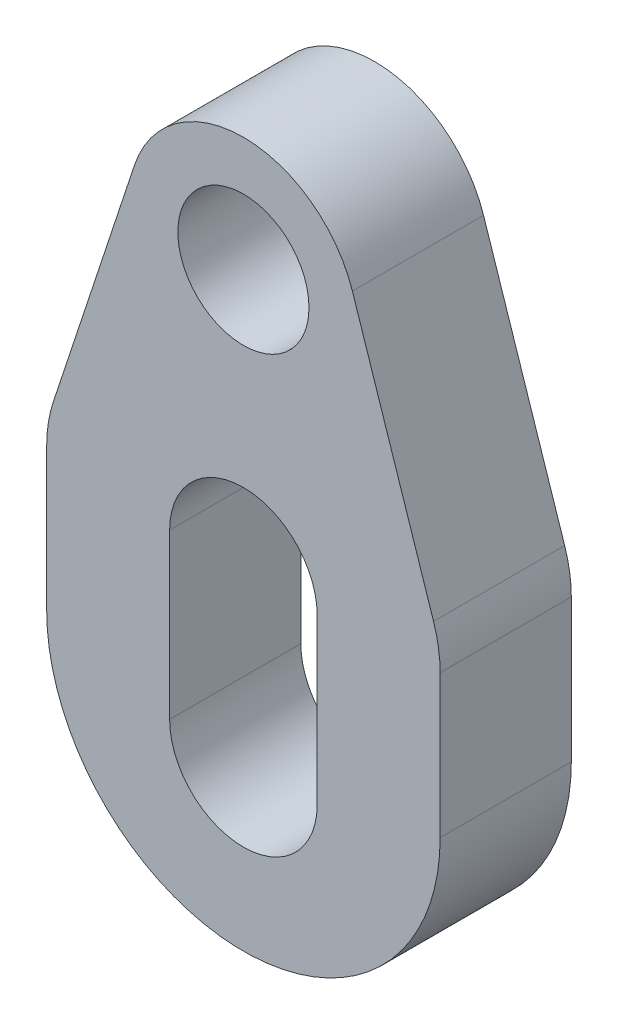
ISO-10303-21;
HEADER;
FILE_DESCRIPTION(('STEP AP214'),'2;1');
FILE_NAME('part.step','',(''),(''),'','','');
FILE_SCHEMA(('AUTOMOTIVE_DESIGN { 1 0 10303 214 1 1 1 1 }'));
ENDSEC;
DATA;
#1=APPLICATION_CONTEXT('core data for automotive mechanical design processes');
#2=APPLICATION_PROTOCOL_DEFINITION('international standard','automotive_design',2000,#1);
#3=PRODUCT_CONTEXT('',#1,'mechanical');
#4=PRODUCT('Part','Part','',(#3));
#5=PRODUCT_RELATED_PRODUCT_CATEGORY('part','',(#4));
#6=PRODUCT_DEFINITION_FORMATION('','',#4);
#7=PRODUCT_DEFINITION_CONTEXT('part definition',#1,'design');
#8=PRODUCT_DEFINITION('design','',#6,#7);
#9=PRODUCT_DEFINITION_SHAPE('','',#8);
#10=(LENGTH_UNIT() NAMED_UNIT(*) SI_UNIT(.MILLI.,.METRE.));
#11=(NAMED_UNIT(*) PLANE_ANGLE_UNIT() SI_UNIT($,.RADIAN.));
#12=(NAMED_UNIT(*) SI_UNIT($,.STERADIAN.) SOLID_ANGLE_UNIT());
#13=UNCERTAINTY_MEASURE_WITH_UNIT(LENGTH_MEASURE(1.E-05),#10,'distance_accuracy_value','');
#14=(GEOMETRIC_REPRESENTATION_CONTEXT(3) GLOBAL_UNCERTAINTY_ASSIGNED_CONTEXT((#13)) GLOBAL_UNIT_ASSIGNED_CONTEXT((#10,
#11,#12)) REPRESENTATION_CONTEXT('',''));
#15=CARTESIAN_POINT('',(0.,0.,0.));
#16=DIRECTION('',(0.,0.,1.));
#17=DIRECTION('',(1.,0.,0.));
#18=AXIS2_PLACEMENT_3D('',#15,#16,#17);
#19=CARTESIAN_POINT('',(-9.525,7.93749999999999,6.35));
#20=DIRECTION('',(1.,0.,0.));
#21=DIRECTION('',(0.,1.,0.));
#22=AXIS2_PLACEMENT_3D('',#19,#20,#21);
#23=PLANE('',#22);
#24=DIRECTION('',(0.,-1.,0.));
#25=VECTOR('',#24,1.);
#26=CARTESIAN_POINT('',(-9.525,7.93749999999999,6.35));
#27=LINE('',#26,#25);
#28=CARTESIAN_POINT('',(-9.525,-1.02225712598016,6.35));
#29=VERTEX_POINT('',#28);
#30=CARTESIAN_POINT('',(-9.525,-7.9375,6.35));
#31=VERTEX_POINT('',#30);
#32=EDGE_CURVE('E201',#29,#31,#27,.T.);
#33=ORIENTED_EDGE('',*,*,#32,.F.);
#34=DIRECTION('',(0.,0.,1.));
#35=VECTOR('',#34,1.);
#36=CARTESIAN_POINT('',(-9.525,-1.02225712598016,0.));
#37=LINE('',#36,#35);
#38=CARTESIAN_POINT('',(-9.525,-1.02225712598016,0.));
#39=VERTEX_POINT('',#38);
#40=EDGE_CURVE('E50',#29,#39,#37,.F.);
#41=ORIENTED_EDGE('',*,*,#40,.T.);
#42=DIRECTION('',(0.,-1.,0.));
#43=VECTOR('',#42,1.);
#44=CARTESIAN_POINT('',(-9.525,7.93749999999999,0.));
#45=LINE('',#44,#43);
#46=CARTESIAN_POINT('',(-9.525,-7.9375,0.));
#47=VERTEX_POINT('',#46);
#48=EDGE_CURVE('E200',#39,#47,#45,.T.);
#49=ORIENTED_EDGE('',*,*,#48,.T.);
#50=DIRECTION('',(0.,0.,-1.));
#51=VECTOR('',#50,1.);
#52=CARTESIAN_POINT('',(-9.525,-7.9375,6.35));
#53=LINE('',#52,#51);
#54=EDGE_CURVE('E217',#31,#47,#53,.T.);
#55=ORIENTED_EDGE('',*,*,#54,.F.);
#56=EDGE_LOOP('',(#33,#41,#49,#55));
#57=FACE_BOUND('',#56,.T.);
#58=ADVANCED_FACE('F42',(#57),#23,.F.);
#59=CARTESIAN_POINT('',(9.52499999999999,7.93750000000001,6.35));
#60=DIRECTION('',(-1.,0.,0.));
#61=DIRECTION('',(0.,-1.,0.));
#62=AXIS2_PLACEMENT_3D('',#59,#60,#61);
#63=PLANE('',#62);
#64=DIRECTION('',(0.,1.,0.));
#65=VECTOR('',#64,1.);
#66=CARTESIAN_POINT('',(9.52499999999999,7.93750000000001,0.));
#67=LINE('',#66,#65);
#68=CARTESIAN_POINT('',(9.525,-7.9375,0.));
#69=VERTEX_POINT('',#68);
#70=CARTESIAN_POINT('',(9.525,-1.02225712598016,0.));
#71=VERTEX_POINT('',#70);
#72=EDGE_CURVE('E204',#69,#71,#67,.T.);
#73=ORIENTED_EDGE('',*,*,#72,.T.);
#74=DIRECTION('',(0.,0.,1.));
#75=VECTOR('',#74,1.);
#76=CARTESIAN_POINT('',(9.525,-1.02225712598016,6.35));
#77=LINE('',#76,#75);
#78=CARTESIAN_POINT('',(9.525,-1.02225712598016,6.35));
#79=VERTEX_POINT('',#78);
#80=EDGE_CURVE('E225',#71,#79,#77,.T.);
#81=ORIENTED_EDGE('',*,*,#80,.T.);
#82=DIRECTION('',(0.,1.,0.));
#83=VECTOR('',#82,1.);
#84=CARTESIAN_POINT('',(9.52499999999999,7.93750000000001,6.35));
#85=LINE('',#84,#83);
#86=CARTESIAN_POINT('',(9.525,-7.9375,6.35));
#87=VERTEX_POINT('',#86);
#88=EDGE_CURVE('E206',#87,#79,#85,.T.);
#89=ORIENTED_EDGE('',*,*,#88,.F.);
#90=DIRECTION('',(0.,0.,-1.));
#91=VECTOR('',#90,1.);
#92=CARTESIAN_POINT('',(9.525,-7.9375,6.35));
#93=LINE('',#92,#91);
#94=EDGE_CURVE('E209',#87,#69,#93,.T.);
#95=ORIENTED_EDGE('',*,*,#94,.T.);
#96=EDGE_LOOP('',(#73,#81,#89,#95));
#97=FACE_BOUND('',#96,.T.);
#98=ADVANCED_FACE('F243',(#97),#63,.F.);
#99=CARTESIAN_POINT('',(0.,7.9375,6.35));
#100=DIRECTION('',(0.,0.,1.));
#101=DIRECTION('',(1.,0.,0.));
#102=AXIS2_PLACEMENT_3D('',#99,#100,#101);
#103=PLANE('',#102);
#104=DIRECTION('',(0.,-1.,0.));
#105=VECTOR('',#104,1.);
#106=CARTESIAN_POINT('',(-3.571875,-9.525,6.35));
#107=LINE('',#106,#105);
#108=CARTESIAN_POINT('',(-3.571875,-1.5875,6.35));
#109=VERTEX_POINT('',#108);
#110=CARTESIAN_POINT('',(-3.571875,-9.525,6.35));
#111=VERTEX_POINT('',#110);
#112=EDGE_CURVE('E180',#109,#111,#107,.T.);
#113=ORIENTED_EDGE('',*,*,#112,.F.);
#114=CARTESIAN_POINT('',(0.,-1.5875,6.35));
#115=DIRECTION('',(0.,0.,1.));
#116=DIRECTION('',(1.,0.,0.));
#117=AXIS2_PLACEMENT_3D('',#114,#115,#116);
#118=CIRCLE('',#117,3.571875);
#119=CARTESIAN_POINT('',(3.571875,-1.5875,6.35));
#120=VERTEX_POINT('',#119);
#121=EDGE_CURVE('E177',#120,#109,#118,.T.);
#122=ORIENTED_EDGE('',*,*,#121,.F.);
#123=DIRECTION('',(0.,1.,0.));
#124=VECTOR('',#123,1.);
#125=CARTESIAN_POINT('',(3.571875,-9.525,6.35));
#126=LINE('',#125,#124);
#127=CARTESIAN_POINT('',(3.571875,-9.525,6.35));
#128=VERTEX_POINT('',#127);
#129=EDGE_CURVE('E174',#128,#120,#126,.T.);
#130=ORIENTED_EDGE('',*,*,#129,.F.);
#131=CARTESIAN_POINT('',(0.,-9.525,6.35));
#132=DIRECTION('',(0.,0.,1.));
#133=DIRECTION('',(1.,0.,0.));
#134=AXIS2_PLACEMENT_3D('',#131,#132,#133);
#135=CIRCLE('',#134,3.571875);
#136=EDGE_CURVE('E188',#111,#128,#135,.T.);
#137=ORIENTED_EDGE('',*,*,#136,.F.);
#138=EDGE_LOOP('',(#113,#122,#130,#137));
#139=FACE_BOUND('',#138,.T.);
#140=CARTESIAN_POINT('',(0.,11.1125,6.35));
#141=DIRECTION('',(0.,0.,1.));
#142=DIRECTION('',(1.,0.,0.));
#143=AXIS2_PLACEMENT_3D('',#140,#141,#142);
#144=CIRCLE('',#143,3.175);
#145=CARTESIAN_POINT('',(3.175,11.1125,6.35));
#146=VERTEX_POINT('',#145);
#147=EDGE_CURVE('E194',#146,#146,#144,.T.);
#148=ORIENTED_EDGE('',*,*,#147,.F.);
#149=EDGE_LOOP('',(#148));
#150=FACE_BOUND('',#149,.T.);
#151=ORIENTED_EDGE('',*,*,#88,.T.);
#152=CARTESIAN_POINT('',(3.175,-1.02225712598016,6.35));
#153=DIRECTION('',(0.,0.,1.));
#154=DIRECTION('',(1.,0.,0.));
#155=AXIS2_PLACEMENT_3D('',#152,#153,#154);
#156=CIRCLE('',#155,6.35);
#157=CARTESIAN_POINT('',(9.20417763385506,0.970609417324182,6.35));
#158=VERTEX_POINT('',#157);
#159=EDGE_CURVE('E228',#79,#158,#156,.T.);
#160=ORIENTED_EDGE('',*,*,#159,.T.);
#161=DIRECTION('',(0.31383725091407,-0.949476792733082,0.));
#162=VECTOR('',#161,1.);
#163=CARTESIAN_POINT('',(8.58684636391611,2.8382708008225,6.35));
#164=LINE('',#163,#162);
#165=CARTESIAN_POINT('',(5.27553042962318,12.8562582253913,6.35));
#166=VERTEX_POINT('',#165);
#167=EDGE_CURVE('E155',#166,#158,#164,.T.);
#168=ORIENTED_EDGE('',*,*,#167,.F.);
#169=CARTESIAN_POINT('',(0.,11.1125,6.35));
#170=DIRECTION('',(0.,0.,1.));
#171=DIRECTION('',(1.,0.,0.));
#172=AXIS2_PLACEMENT_3D('',#169,#170,#171);
#173=CIRCLE('',#172,5.55625);
#174=CARTESIAN_POINT('',(-5.27553042962318,12.8562582253913,6.35));
#175=VERTEX_POINT('',#174);
#176=EDGE_CURVE('E148',#166,#175,#173,.T.);
#177=ORIENTED_EDGE('',*,*,#176,.T.);
#178=DIRECTION('',(0.31383725091407,0.949476792733082,0.));
#179=VECTOR('',#178,1.);
#180=CARTESIAN_POINT('',(-8.58684636391611,2.83827080082251,6.35));
#181=LINE('',#180,#179);
#182=CARTESIAN_POINT('',(-9.20417763385507,0.970609417324181,6.35));
#183=VERTEX_POINT('',#182);
#184=EDGE_CURVE('E158',#183,#175,#181,.T.);
#185=ORIENTED_EDGE('',*,*,#184,.F.);
#186=CARTESIAN_POINT('',(-3.175,-1.02225712598016,6.35));
#187=DIRECTION('',(0.,0.,1.));
#188=DIRECTION('',(1.,0.,0.));
#189=AXIS2_PLACEMENT_3D('',#186,#187,#188);
#190=CIRCLE('',#189,6.35);
#191=EDGE_CURVE('E57',#183,#29,#190,.T.);
#192=ORIENTED_EDGE('',*,*,#191,.T.);
#193=ORIENTED_EDGE('',*,*,#32,.T.);
#194=CARTESIAN_POINT('',(0.,-7.9375,6.35));
#195=DIRECTION('',(0.,0.,1.));
#196=DIRECTION('',(1.,0.,0.));
#197=AXIS2_PLACEMENT_3D('',#194,#195,#196);
#198=CIRCLE('',#197,9.525);
#199=EDGE_CURVE('E203',#31,#87,#198,.T.);
#200=ORIENTED_EDGE('',*,*,#199,.T.);
#201=EDGE_LOOP('',(#151,#160,#168,#177,#185,#192,#193,#200));
#202=FACE_BOUND('',#201,.T.);
#203=ADVANCED_FACE('F246',(#139,#150,#202),#103,.T.);
#204=CARTESIAN_POINT('',(0.,7.9375,0.));
#205=DIRECTION('',(0.,0.,1.));
#206=DIRECTION('',(1.,0.,0.));
#207=AXIS2_PLACEMENT_3D('',#204,#205,#206);
#208=PLANE('',#207);
#209=CARTESIAN_POINT('',(0.,11.1125,0.));
#210=DIRECTION('',(0.,0.,1.));
#211=DIRECTION('',(1.,0.,0.));
#212=AXIS2_PLACEMENT_3D('',#209,#210,#211);
#213=CIRCLE('',#212,3.175);
#214=CARTESIAN_POINT('',(3.175,11.1125,0.));
#215=VERTEX_POINT('',#214);
#216=EDGE_CURVE('E197',#215,#215,#213,.T.);
#217=ORIENTED_EDGE('',*,*,#216,.T.);
#218=EDGE_LOOP('',(#217));
#219=FACE_BOUND('',#218,.T.);
#220=CARTESIAN_POINT('',(0.,-1.5875,0.));
#221=DIRECTION('',(0.,0.,1.));
#222=DIRECTION('',(1.,0.,0.));
#223=AXIS2_PLACEMENT_3D('',#220,#221,#222);
#224=CIRCLE('',#223,3.571875);
#225=CARTESIAN_POINT('',(-3.571875,-1.5875,0.));
#226=VERTEX_POINT('',#225);
#227=CARTESIAN_POINT('',(3.571875,-1.5875,0.));
#228=VERTEX_POINT('',#227);
#229=EDGE_CURVE('E168',#226,#228,#224,.F.);
#230=ORIENTED_EDGE('',*,*,#229,.F.);
#231=DIRECTION('',(0.,1.,0.));
#232=VECTOR('',#231,1.);
#233=CARTESIAN_POINT('',(-3.571875,-9.525,0.));
#234=LINE('',#233,#232);
#235=CARTESIAN_POINT('',(-3.571875,-9.525,0.));
#236=VERTEX_POINT('',#235);
#237=EDGE_CURVE('E171',#236,#226,#234,.T.);
#238=ORIENTED_EDGE('',*,*,#237,.F.);
#239=CARTESIAN_POINT('',(0.,-9.525,0.));
#240=DIRECTION('',(0.,0.,1.));
#241=DIRECTION('',(1.,0.,0.));
#242=AXIS2_PLACEMENT_3D('',#239,#240,#241);
#243=CIRCLE('',#242,3.571875);
#244=CARTESIAN_POINT('',(3.571875,-9.525,0.));
#245=VERTEX_POINT('',#244);
#246=EDGE_CURVE('E191',#236,#245,#243,.T.);
#247=ORIENTED_EDGE('',*,*,#246,.T.);
#248=DIRECTION('',(0.,-1.,0.));
#249=VECTOR('',#248,1.);
#250=CARTESIAN_POINT('',(3.571875,-9.525,0.));
#251=LINE('',#250,#249);
#252=EDGE_CURVE('E185',#228,#245,#251,.T.);
#253=ORIENTED_EDGE('',*,*,#252,.F.);
#254=EDGE_LOOP('',(#230,#238,#247,#253));
#255=FACE_BOUND('',#254,.T.);
#256=DIRECTION('',(0.31383725091407,-0.949476792733082,0.));
#257=VECTOR('',#256,1.);
#258=CARTESIAN_POINT('',(8.58684636391611,2.8382708008225,0.));
#259=LINE('',#258,#257);
#260=CARTESIAN_POINT('',(5.27553042962318,12.8562582253913,0.));
#261=VERTEX_POINT('',#260);
#262=CARTESIAN_POINT('',(9.20417763385506,0.970609417324182,0.));
#263=VERTEX_POINT('',#262);
#264=EDGE_CURVE('E131',#261,#263,#259,.T.);
#265=ORIENTED_EDGE('',*,*,#264,.T.);
#266=CARTESIAN_POINT('',(3.175,-1.02225712598016,0.));
#267=DIRECTION('',(0.,0.,1.));
#268=DIRECTION('',(1.,0.,0.));
#269=AXIS2_PLACEMENT_3D('',#266,#267,#268);
#270=CIRCLE('',#269,6.35);
#271=EDGE_CURVE('E223',#263,#71,#270,.F.);
#272=ORIENTED_EDGE('',*,*,#271,.T.);
#273=ORIENTED_EDGE('',*,*,#72,.F.);
#274=CARTESIAN_POINT('',(0.,-7.9375,0.));
#275=DIRECTION('',(0.,0.,1.));
#276=DIRECTION('',(1.,0.,0.));
#277=AXIS2_PLACEMENT_3D('',#274,#275,#276);
#278=CIRCLE('',#277,9.525);
#279=EDGE_CURVE('E211',#47,#69,#278,.T.);
#280=ORIENTED_EDGE('',*,*,#279,.F.);
#281=ORIENTED_EDGE('',*,*,#48,.F.);
#282=CARTESIAN_POINT('',(-3.175,-1.02225712598016,0.));
#283=DIRECTION('',(0.,0.,1.));
#284=DIRECTION('',(1.,0.,0.));
#285=AXIS2_PLACEMENT_3D('',#282,#283,#284);
#286=CIRCLE('',#285,6.35);
#287=CARTESIAN_POINT('',(-9.20417763385507,0.970609417324181,0.));
#288=VERTEX_POINT('',#287);
#289=EDGE_CURVE('E221',#39,#288,#286,.F.);
#290=ORIENTED_EDGE('',*,*,#289,.T.);
#291=DIRECTION('',(0.31383725091407,0.949476792733082,0.));
#292=VECTOR('',#291,1.);
#293=CARTESIAN_POINT('',(-8.58684636391611,2.83827080082251,0.));
#294=LINE('',#293,#292);
#295=CARTESIAN_POINT('',(-5.27553042962318,12.8562582253913,0.));
#296=VERTEX_POINT('',#295);
#297=EDGE_CURVE('E152',#288,#296,#294,.T.);
#298=ORIENTED_EDGE('',*,*,#297,.T.);
#299=CARTESIAN_POINT('',(0.,11.1125,0.));
#300=DIRECTION('',(0.,0.,1.));
#301=DIRECTION('',(1.,0.,0.));
#302=AXIS2_PLACEMENT_3D('',#299,#300,#301);
#303=CIRCLE('',#302,5.55625);
#304=EDGE_CURVE('E141',#261,#296,#303,.T.);
#305=ORIENTED_EDGE('',*,*,#304,.F.);
#306=EDGE_LOOP('',(#265,#272,#273,#280,#281,#290,#298,#305));
#307=FACE_BOUND('',#306,.T.);
#308=ADVANCED_FACE('F151',(#219,#255,#307),#208,.F.);
#309=CARTESIAN_POINT('',(0.,-9.525,6.35));
#310=DIRECTION('',(0.,0.,1.));
#311=DIRECTION('',(1.,0.,0.));
#312=AXIS2_PLACEMENT_3D('',#309,#310,#311);
#313=CYLINDRICAL_SURFACE('',#312,3.571875);
#314=DIRECTION('',(0.,0.,1.));
#315=VECTOR('',#314,1.);
#316=CARTESIAN_POINT('',(-3.571875,-9.525,6.35));
#317=LINE('',#316,#315);
#318=EDGE_CURVE('E165',#236,#111,#317,.T.);
#319=ORIENTED_EDGE('',*,*,#318,.T.);
#320=ORIENTED_EDGE('',*,*,#136,.T.);
#321=DIRECTION('',(0.,0.,1.));
#322=VECTOR('',#321,1.);
#323=CARTESIAN_POINT('',(3.571875,-9.525,6.35));
#324=LINE('',#323,#322);
#325=EDGE_CURVE('E163',#245,#128,#324,.T.);
#326=ORIENTED_EDGE('',*,*,#325,.F.);
#327=ORIENTED_EDGE('',*,*,#246,.F.);
#328=EDGE_LOOP('',(#319,#320,#326,#327));
#329=FACE_BOUND('',#328,.T.);
#330=ADVANCED_FACE('F265',(#329),#313,.F.);
#331=CARTESIAN_POINT('',(0.,-7.9375,6.35));
#332=DIRECTION('',(0.,0.,-1.));
#333=DIRECTION('',(-1.,0.,0.));
#334=AXIS2_PLACEMENT_3D('',#331,#332,#333);
#335=CYLINDRICAL_SURFACE('',#334,9.525);
#336=ORIENTED_EDGE('',*,*,#279,.T.);
#337=ORIENTED_EDGE('',*,*,#94,.F.);
#338=ORIENTED_EDGE('',*,*,#199,.F.);
#339=ORIENTED_EDGE('',*,*,#54,.T.);
#340=EDGE_LOOP('',(#336,#337,#338,#339));
#341=FACE_BOUND('',#340,.T.);
#342=ADVANCED_FACE('F239',(#341),#335,.T.);
#343=CARTESIAN_POINT('',(0.,11.1125,6.35));
#344=DIRECTION('',(0.,0.,1.));
#345=DIRECTION('',(1.,0.,0.));
#346=AXIS2_PLACEMENT_3D('',#343,#344,#345);
#347=CYLINDRICAL_SURFACE('',#346,3.175);
#348=ORIENTED_EDGE('',*,*,#216,.F.);
#349=EDGE_LOOP('',(#348));
#350=FACE_BOUND('',#349,.T.);
#351=ORIENTED_EDGE('',*,*,#147,.T.);
#352=EDGE_LOOP('',(#351));
#353=FACE_BOUND('',#352,.T.);
#354=ADVANCED_FACE('F264',(#350,#353),#347,.F.);
#355=CARTESIAN_POINT('',(-3.571875,-9.525,-0.00100000000000013));
#356=DIRECTION('',(-1.,0.,0.));
#357=DIRECTION('',(0.,0.,1.));
#358=AXIS2_PLACEMENT_3D('',#355,#356,#357);
#359=PLANE('',#358);
#360=ORIENTED_EDGE('',*,*,#237,.T.);
#361=DIRECTION('',(0.,0.,1.));
#362=VECTOR('',#361,1.);
#363=CARTESIAN_POINT('',(-3.571875,-1.5875,-0.00100000000000013));
#364=LINE('',#363,#362);
#365=EDGE_CURVE('E183',#226,#109,#364,.T.);
#366=ORIENTED_EDGE('',*,*,#365,.T.);
#367=ORIENTED_EDGE('',*,*,#112,.T.);
#368=ORIENTED_EDGE('',*,*,#318,.F.);
#369=EDGE_LOOP('',(#360,#366,#367,#368));
#370=FACE_BOUND('',#369,.T.);
#371=ADVANCED_FACE('F275',(#370),#359,.F.);
#372=CARTESIAN_POINT('',(0.,-1.5875,-0.00100000000000013));
#373=DIRECTION('',(0.,0.,1.));
#374=DIRECTION('',(1.,0.,0.));
#375=AXIS2_PLACEMENT_3D('',#372,#373,#374);
#376=CYLINDRICAL_SURFACE('',#375,3.571875);
#377=ORIENTED_EDGE('',*,*,#229,.T.);
#378=DIRECTION('',(0.,0.,1.));
#379=VECTOR('',#378,1.);
#380=CARTESIAN_POINT('',(3.571875,-1.5875,-0.00100000000000013));
#381=LINE('',#380,#379);
#382=EDGE_CURVE('E182',#228,#120,#381,.T.);
#383=ORIENTED_EDGE('',*,*,#382,.T.);
#384=ORIENTED_EDGE('',*,*,#121,.T.);
#385=ORIENTED_EDGE('',*,*,#365,.F.);
#386=EDGE_LOOP('',(#377,#383,#384,#385));
#387=FACE_BOUND('',#386,.T.);
#388=ADVANCED_FACE('F283',(#387),#376,.F.);
#389=CARTESIAN_POINT('',(3.571875,-9.525,-0.00100000000000013));
#390=DIRECTION('',(1.,0.,0.));
#391=DIRECTION('',(0.,0.,-1.));
#392=AXIS2_PLACEMENT_3D('',#389,#390,#391);
#393=PLANE('',#392);
#394=ORIENTED_EDGE('',*,*,#252,.T.);
#395=ORIENTED_EDGE('',*,*,#325,.T.);
#396=ORIENTED_EDGE('',*,*,#129,.T.);
#397=ORIENTED_EDGE('',*,*,#382,.F.);
#398=EDGE_LOOP('',(#394,#395,#396,#397));
#399=FACE_BOUND('',#398,.T.);
#400=ADVANCED_FACE('F280',(#399),#393,.F.);
#401=CARTESIAN_POINT('',(0.,11.1125,6.35));
#402=DIRECTION('',(0.,0.,1.));
#403=DIRECTION('',(1.,0.,0.));
#404=AXIS2_PLACEMENT_3D('',#401,#402,#403);
#405=CYLINDRICAL_SURFACE('',#404,5.55625);
#406=DIRECTION('',(0.,0.,1.));
#407=VECTOR('',#406,1.);
#408=CARTESIAN_POINT('',(-5.27553042962318,12.8562582253913,6.35));
#409=LINE('',#408,#407);
#410=EDGE_CURVE('E149',#175,#296,#409,.F.);
#411=ORIENTED_EDGE('',*,*,#410,.F.);
#412=ORIENTED_EDGE('',*,*,#176,.F.);
#413=DIRECTION('',(0.,0.,1.));
#414=VECTOR('',#413,1.);
#415=CARTESIAN_POINT('',(5.27553042962318,12.8562582253913,6.35));
#416=LINE('',#415,#414);
#417=EDGE_CURVE('E135',#166,#261,#416,.F.);
#418=ORIENTED_EDGE('',*,*,#417,.T.);
#419=ORIENTED_EDGE('',*,*,#304,.T.);
#420=EDGE_LOOP('',(#411,#412,#418,#419));
#421=FACE_BOUND('',#420,.T.);
#422=ADVANCED_FACE('F146',(#421),#405,.T.);
#423=CARTESIAN_POINT('',(8.58684636391611,2.8382708008225,6.35));
#424=DIRECTION('',(-0.949476792733082,-0.31383725091407,0.));
#425=DIRECTION('',(0.31383725091407,-0.949476792733082,0.));
#426=AXIS2_PLACEMENT_3D('',#423,#424,#425);
#427=PLANE('',#426);
#428=ORIENTED_EDGE('',*,*,#167,.T.);
#429=DIRECTION('',(0.,0.,-1.));
#430=VECTOR('',#429,1.);
#431=CARTESIAN_POINT('',(9.20417763385506,0.970609417324182,0.));
#432=LINE('',#431,#430);
#433=EDGE_CURVE('E138',#158,#263,#432,.T.);
#434=ORIENTED_EDGE('',*,*,#433,.T.);
#435=ORIENTED_EDGE('',*,*,#264,.F.);
#436=ORIENTED_EDGE('',*,*,#417,.F.);
#437=EDGE_LOOP('',(#428,#434,#435,#436));
#438=FACE_BOUND('',#437,.T.);
#439=ADVANCED_FACE('F134',(#438),#427,.F.);
#440=CARTESIAN_POINT('',(-8.58684636391611,2.83827080082251,6.35));
#441=DIRECTION('',(0.949476792733082,-0.31383725091407,0.));
#442=DIRECTION('',(0.31383725091407,0.949476792733082,0.));
#443=AXIS2_PLACEMENT_3D('',#440,#441,#442);
#444=PLANE('',#443);
#445=ORIENTED_EDGE('',*,*,#297,.F.);
#446=DIRECTION('',(0.,0.,-1.));
#447=VECTOR('',#446,1.);
#448=CARTESIAN_POINT('',(-9.20417763385507,0.970609417324181,6.35));
#449=LINE('',#448,#447);
#450=EDGE_CURVE('E11',#288,#183,#449,.F.);
#451=ORIENTED_EDGE('',*,*,#450,.T.);
#452=ORIENTED_EDGE('',*,*,#184,.T.);
#453=ORIENTED_EDGE('',*,*,#410,.T.);
#454=EDGE_LOOP('',(#445,#451,#452,#453));
#455=FACE_BOUND('',#454,.T.);
#456=ADVANCED_FACE('F250',(#455),#444,.F.);
#457=CARTESIAN_POINT('',(3.175,-1.02225712598016,6.35));
#458=DIRECTION('',(0.,0.,-1.));
#459=DIRECTION('',(-1.,0.,0.));
#460=AXIS2_PLACEMENT_3D('',#457,#458,#459);
#461=CYLINDRICAL_SURFACE('',#460,6.35);
#462=ORIENTED_EDGE('',*,*,#159,.F.);
#463=ORIENTED_EDGE('',*,*,#80,.F.);
#464=ORIENTED_EDGE('',*,*,#271,.F.);
#465=ORIENTED_EDGE('',*,*,#433,.F.);
#466=EDGE_LOOP('',(#462,#463,#464,#465));
#467=FACE_BOUND('',#466,.T.);
#468=ADVANCED_FACE('F248',(#467),#461,.T.);
#469=CARTESIAN_POINT('',(-3.175,-1.02225712598016,6.35));
#470=DIRECTION('',(0.,0.,-1.));
#471=DIRECTION('',(-1.,0.,0.));
#472=AXIS2_PLACEMENT_3D('',#469,#470,#471);
#473=CYLINDRICAL_SURFACE('',#472,6.35);
#474=ORIENTED_EDGE('',*,*,#191,.F.);
#475=ORIENTED_EDGE('',*,*,#450,.F.);
#476=ORIENTED_EDGE('',*,*,#289,.F.);
#477=ORIENTED_EDGE('',*,*,#40,.F.);
#478=EDGE_LOOP('',(#474,#475,#476,#477));
#479=FACE_BOUND('',#478,.T.);
#480=ADVANCED_FACE('F44',(#479),#473,.T.);
#481=CLOSED_SHELL('',(#58,#98,#203,#308,#330,#342,#354,#371,#388,#400,#422,#439,#456,#468,#480));
#482=MANIFOLD_SOLID_BREP('B2',#481);
#483=ADVANCED_BREP_SHAPE_REPRESENTATION('',(#18,#482),#14);
#484=SHAPE_DEFINITION_REPRESENTATION(#9,#483);
ENDSEC;
END-ISO-10303-21;
